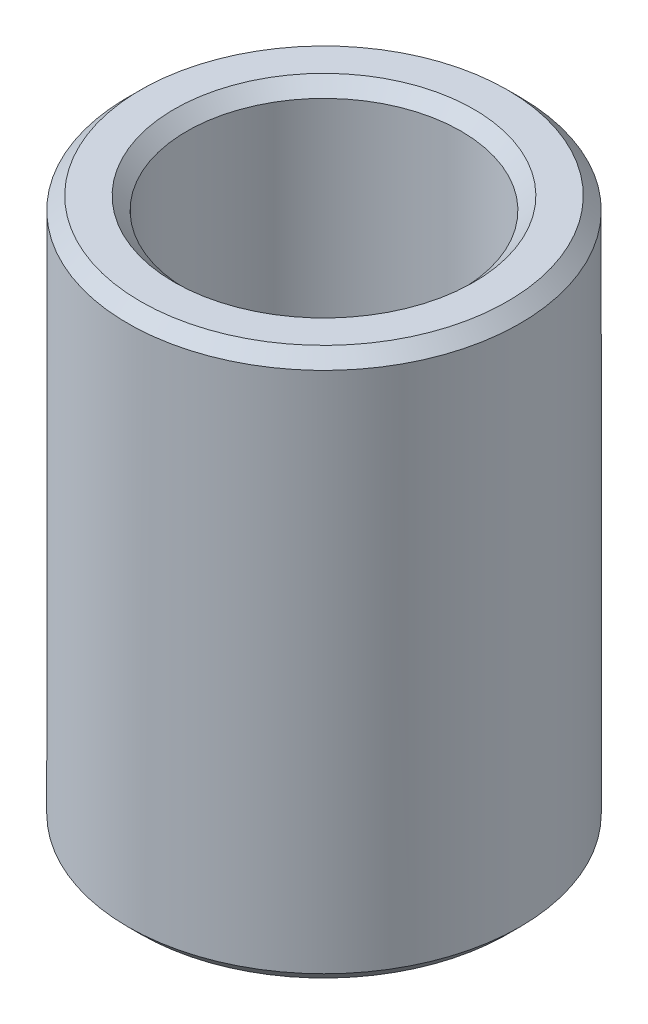
ISO-10303-21;
HEADER;
FILE_DESCRIPTION(('STEP AP214'),'2;1');
FILE_NAME('part.step','',(''),(''),'','','');
FILE_SCHEMA(('AUTOMOTIVE_DESIGN { 1 0 10303 214 1 1 1 1 }'));
ENDSEC;
DATA;
#1=APPLICATION_CONTEXT('core data for automotive mechanical design processes');
#2=APPLICATION_PROTOCOL_DEFINITION('international standard','automotive_design',2000,#1);
#3=PRODUCT_CONTEXT('',#1,'mechanical');
#4=PRODUCT('Part','Part','',(#3));
#5=PRODUCT_RELATED_PRODUCT_CATEGORY('part','',(#4));
#6=PRODUCT_DEFINITION_FORMATION('','',#4);
#7=PRODUCT_DEFINITION_CONTEXT('part definition',#1,'design');
#8=PRODUCT_DEFINITION('design','',#6,#7);
#9=PRODUCT_DEFINITION_SHAPE('','',#8);
#10=(LENGTH_UNIT() NAMED_UNIT(*) SI_UNIT(.MILLI.,.METRE.));
#11=(NAMED_UNIT(*) PLANE_ANGLE_UNIT() SI_UNIT($,.RADIAN.));
#12=(NAMED_UNIT(*) SI_UNIT($,.STERADIAN.) SOLID_ANGLE_UNIT());
#13=UNCERTAINTY_MEASURE_WITH_UNIT(LENGTH_MEASURE(1.E-05),#10,'distance_accuracy_value','');
#14=(GEOMETRIC_REPRESENTATION_CONTEXT(3) GLOBAL_UNCERTAINTY_ASSIGNED_CONTEXT((#13)) GLOBAL_UNIT_ASSIGNED_CONTEXT((#10,
#11,#12)) REPRESENTATION_CONTEXT('',''));
#15=CARTESIAN_POINT('',(0.,0.,0.));
#16=DIRECTION('',(0.,0.,1.));
#17=DIRECTION('',(1.,0.,0.));
#18=AXIS2_PLACEMENT_3D('',#15,#16,#17);
#19=CARTESIAN_POINT('',(0.,118.777284969492,0.));
#20=DIRECTION('',(0.,-1.,0.));
#21=DIRECTION('',(0.,0.,-1.));
#22=AXIS2_PLACEMENT_3D('',#19,#20,#21);
#23=CYLINDRICAL_SURFACE('',#22,42.5);
#24=CARTESIAN_POINT('',(0.,2.75292332349363,0.));
#25=DIRECTION('',(0.,1.,0.));
#26=DIRECTION('',(0.,0.,1.));
#27=AXIS2_PLACEMENT_3D('',#24,#25,#26);
#28=CIRCLE('',#27,42.5);
#29=CARTESIAN_POINT('',(0.,2.75292332349361,-42.5));
#30=VERTEX_POINT('',#29);
#31=EDGE_CURVE('E10',#30,#30,#28,.T.);
#32=CARTESIAN_POINT('',(0.,116.024361645999,0.));
#33=DIRECTION('',(0.,1.,0.));
#34=DIRECTION('',(0.,0.,1.));
#35=AXIS2_PLACEMENT_3D('',#32,#33,#34);
#36=CIRCLE('',#35,42.5);
#37=CARTESIAN_POINT('',(0.,116.024361645999,-42.5));
#38=VERTEX_POINT('',#37);
#39=EDGE_CURVE('E50',#38,#38,#36,.F.);
#40=CARTESIAN_POINT('',(0.,2.75292332349361,-42.5));
#41=CARTESIAN_POINT('',(0.,3.93283413935304,-42.5));
#42=CARTESIAN_POINT('',(0.,5.11274495521248,-42.5));
#43=CARTESIAN_POINT('',(0.,7.47256658693134,-42.5));
#44=CARTESIAN_POINT('',(0.,8.65247740279077,-42.5));
#45=CARTESIAN_POINT('',(0.,11.0122990345096,-42.5));
#46=CARTESIAN_POINT('',(0.,12.1922098503691,-42.5));
#47=CARTESIAN_POINT('',(0.,14.5520314820879,-42.5));
#48=CARTESIAN_POINT('',(0.,15.7319422979474,-42.5));
#49=CARTESIAN_POINT('',(0.,18.0917639296662,-42.5));
#50=CARTESIAN_POINT('',(0.,19.2716747455257,-42.5));
#51=CARTESIAN_POINT('',(0.,21.6314963772445,-42.5));
#52=CARTESIAN_POINT('',(0.,22.811407193104,-42.5));
#53=CARTESIAN_POINT('',(0.,25.1712288248228,-42.5));
#54=CARTESIAN_POINT('',(0.,26.3511396406822,-42.5));
#55=CARTESIAN_POINT('',(0.,28.7109612724011,-42.5));
#56=CARTESIAN_POINT('',(0.,29.8908720882605,-42.5));
#57=CARTESIAN_POINT('',(0.,32.2506937199794,-42.5));
#58=CARTESIAN_POINT('',(0.,33.4306045358388,-42.5));
#59=CARTESIAN_POINT('',(0.,35.7904261675577,-42.5));
#60=CARTESIAN_POINT('',(0.,36.9703369834171,-42.5));
#61=CARTESIAN_POINT('',(0.,39.330158615136,-42.5));
#62=CARTESIAN_POINT('',(0.,40.5100694309954,-42.5));
#63=CARTESIAN_POINT('',(0.,42.8698910627143,-42.5));
#64=CARTESIAN_POINT('',(0.,44.0498018785737,-42.5));
#65=CARTESIAN_POINT('',(0.,46.4096235102926,-42.5));
#66=CARTESIAN_POINT('',(0.,47.589534326152,-42.5));
#67=CARTESIAN_POINT('',(0.,49.9493559578709,-42.5));
#68=CARTESIAN_POINT('',(0.,51.1292667737303,-42.5));
#69=CARTESIAN_POINT('',(0.,53.4890884054492,-42.5));
#70=CARTESIAN_POINT('',(0.,54.6689992213086,-42.5));
#71=CARTESIAN_POINT('',(0.,57.0288208530275,-42.5));
#72=CARTESIAN_POINT('',(0.,58.2087316688869,-42.5));
#73=CARTESIAN_POINT('',(0.,60.5685533006057,-42.5));
#74=CARTESIAN_POINT('',(0.,61.7484641164652,-42.5));
#75=CARTESIAN_POINT('',(0.,64.108285748184,-42.5));
#76=CARTESIAN_POINT('',(0.,65.2881965640435,-42.5));
#77=CARTESIAN_POINT('',(0.,67.6480181957623,-42.5));
#78=CARTESIAN_POINT('',(0.,68.8279290116218,-42.5));
#79=CARTESIAN_POINT('',(0.,71.1877506433406,-42.5));
#80=CARTESIAN_POINT('',(0.,72.3676614592001,-42.5));
#81=CARTESIAN_POINT('',(0.,74.7274830909189,-42.5));
#82=CARTESIAN_POINT('',(0.,75.9073939067784,-42.5));
#83=CARTESIAN_POINT('',(0.,78.2672155384972,-42.5));
#84=CARTESIAN_POINT('',(0.,79.4471263543567,-42.5));
#85=CARTESIAN_POINT('',(0.,81.8069479860755,-42.5));
#86=CARTESIAN_POINT('',(0.,82.986858801935,-42.5));
#87=CARTESIAN_POINT('',(0.,85.3466804336538,-42.5));
#88=CARTESIAN_POINT('',(0.,86.5265912495133,-42.5));
#89=CARTESIAN_POINT('',(0.,88.8864128812321,-42.5));
#90=CARTESIAN_POINT('',(0.,90.0663236970915,-42.5));
#91=CARTESIAN_POINT('',(0.,92.4261453288104,-42.5));
#92=CARTESIAN_POINT('',(0.,93.6060561446698,-42.5));
#93=CARTESIAN_POINT('',(0.,95.9658777763887,-42.5));
#94=CARTESIAN_POINT('',(0.,97.1457885922481,-42.5));
#95=CARTESIAN_POINT('',(0.,99.505610223967,-42.5));
#96=CARTESIAN_POINT('',(0.,100.685521039826,-42.5));
#97=CARTESIAN_POINT('',(0.,103.045342671545,-42.5));
#98=CARTESIAN_POINT('',(0.,104.225253487405,-42.5));
#99=CARTESIAN_POINT('',(0.,106.585075119124,-42.5));
#100=CARTESIAN_POINT('',(0.,107.764985934983,-42.5));
#101=CARTESIAN_POINT('',(0.,110.124807566702,-42.5));
#102=CARTESIAN_POINT('',(0.,111.304718382561,-42.5));
#103=CARTESIAN_POINT('',(0.,113.66454001428,-42.5));
#104=CARTESIAN_POINT('',(0.,114.84445083014,-42.5));
#105=CARTESIAN_POINT('',(0.,116.024361645999,-42.5));
#106=B_SPLINE_CURVE_WITH_KNOTS('',3,(#40,#41,#42,#43,#44,#45,#46,#47,#48,#49,#50,#51,#52,#53,
#54,#55,#56,#57,#58,#59,#60,#61,#62,#63,#64,#65,#66,#67,#68,#69,#70,#71,#72,#73,#74,#75,#76,#77,
#78,#79,#80,#81,#82,#83,#84,#85,#86,#87,#88,#89,#90,#91,#92,#93,#94,#95,#96,#97,#98,#99,#100,
#101,#102,#103,#104,#105),.UNSPECIFIED.,.F.,.F.,(4,2,2,2,2,2,2,2,2,2,2,2,2,2,2,2,2,2,2,2,2,2,2,
2,2,2,2,2,2,2,2,2,4),(0.,3.5397324475783,7.0794648951566,10.6191973427349,14.1589297903132,
17.6986622378915,21.2383946854698,24.7781271330481,28.3178595806264,31.8575920282046,
35.397324475783,38.9370569233612,42.4767893709395,46.0165218185178,49.5562542660961,
53.0959867136744,56.6357191612527,60.175451608831,63.7151840564093,67.2549165039876,
70.7946489515659,74.3343813991442,77.8741138467225,81.4138462943008,84.9535787418791,
88.4933111894574,92.0330436370357,95.5727760846139,99.1125085321923,102.652240979771,
106.191973427349,109.731705874927,113.271438322505),.UNSPECIFIED.);
#107=EDGE_CURVE('BSEAM39',#30,#38,#106,.T.);
#108=ORIENTED_EDGE('',*,*,#31,.T.);
#109=ORIENTED_EDGE('',*,*,#39,.T.);
#110=ORIENTED_EDGE('',*,*,#107,.T.);
#111=ORIENTED_EDGE('',*,*,#107,.F.);
#112=EDGE_LOOP('',(#108,#110,#109,#111));
#113=FACE_BOUND('',#112,.T.);
#114=ADVANCED_FACE('F39',(#113),#23,.T.);
#115=CARTESIAN_POINT('',(0.,118.777284969492,0.));
#116=DIRECTION('',(0.,1.,0.));
#117=DIRECTION('',(0.,0.,1.));
#118=AXIS2_PLACEMENT_3D('',#115,#116,#117);
#119=PLANE('',#118);
#120=CARTESIAN_POINT('',(0.,118.777284969492,0.));
#121=DIRECTION('',(0.,1.,0.));
#122=DIRECTION('',(0.,0.,1.));
#123=AXIS2_PLACEMENT_3D('',#120,#121,#122);
#124=CIRCLE('',#123,32.4823454216008);
#125=CARTESIAN_POINT('',(0.,118.777284969492,32.4823454216008));
#126=VERTEX_POINT('',#125);
#127=EDGE_CURVE('E58',#126,#126,#124,.F.);
#128=ORIENTED_EDGE('',*,*,#127,.T.);
#129=EDGE_LOOP('',(#128));
#130=FACE_BOUND('',#129,.T.);
#131=CARTESIAN_POINT('',(0.,118.777284969492,0.));
#132=DIRECTION('',(0.,1.,0.));
#133=DIRECTION('',(0.,0.,1.));
#134=AXIS2_PLACEMENT_3D('',#131,#132,#133);
#135=CIRCLE('',#134,39.7470766765066);
#136=CARTESIAN_POINT('',(0.,118.777284969492,39.7470766765066));
#137=VERTEX_POINT('',#136);
#138=EDGE_CURVE('E61',#137,#137,#135,.T.);
#139=ORIENTED_EDGE('',*,*,#138,.T.);
#140=EDGE_LOOP('',(#139));
#141=FACE_BOUND('',#140,.T.);
#142=ADVANCED_FACE('F88',(#130,#141),#119,.T.);
#143=CARTESIAN_POINT('',(0.,0.,0.));
#144=DIRECTION('',(0.,1.,0.));
#145=DIRECTION('',(0.,0.,1.));
#146=AXIS2_PLACEMENT_3D('',#143,#144,#145);
#147=PLANE('',#146);
#148=CARTESIAN_POINT('',(0.,0.,0.));
#149=DIRECTION('',(0.,1.,0.));
#150=DIRECTION('',(0.,0.,1.));
#151=AXIS2_PLACEMENT_3D('',#148,#149,#150);
#152=CIRCLE('',#151,32.4823454216007);
#153=CARTESIAN_POINT('',(0.,0.,32.4823454216007));
#154=VERTEX_POINT('',#153);
#155=EDGE_CURVE('E51',#154,#154,#152,.T.);
#156=ORIENTED_EDGE('',*,*,#155,.T.);
#157=EDGE_LOOP('',(#156));
#158=FACE_BOUND('',#157,.T.);
#159=CARTESIAN_POINT('',(0.,0.,0.));
#160=DIRECTION('',(0.,1.,0.));
#161=DIRECTION('',(0.,0.,1.));
#162=AXIS2_PLACEMENT_3D('',#159,#160,#161);
#163=CIRCLE('',#162,39.7470766765064);
#164=CARTESIAN_POINT('',(0.,0.,39.7470766765064));
#165=VERTEX_POINT('',#164);
#166=EDGE_CURVE('E54',#165,#165,#163,.F.);
#167=ORIENTED_EDGE('',*,*,#166,.T.);
#168=EDGE_LOOP('',(#167));
#169=FACE_BOUND('',#168,.T.);
#170=ADVANCED_FACE('F83',(#158,#169),#147,.F.);
#171=CARTESIAN_POINT('',(0.,118.777284969492,0.));
#172=DIRECTION('',(0.,-1.,0.));
#173=DIRECTION('',(0.,0.,-1.));
#174=AXIS2_PLACEMENT_3D('',#171,#172,#173);
#175=CYLINDRICAL_SURFACE('',#174,29.7294220981071);
#176=CARTESIAN_POINT('',(0.,116.024361645999,0.));
#177=DIRECTION('',(0.,1.,0.));
#178=DIRECTION('',(0.,0.,1.));
#179=AXIS2_PLACEMENT_3D('',#176,#177,#178);
#180=CIRCLE('',#179,29.7294220981071);
#181=CARTESIAN_POINT('',(0.,116.024361645999,-29.7294220981071));
#182=VERTEX_POINT('',#181);
#183=EDGE_CURVE('E67',#182,#182,#180,.T.);
#184=CARTESIAN_POINT('',(0.,2.75292332349354,0.));
#185=DIRECTION('',(0.,1.,0.));
#186=DIRECTION('',(0.,0.,1.));
#187=AXIS2_PLACEMENT_3D('',#184,#185,#186);
#188=CIRCLE('',#187,29.7294220981071);
#189=CARTESIAN_POINT('',(0.,2.75292332349353,-29.7294220981071));
#190=VERTEX_POINT('',#189);
#191=EDGE_CURVE('E69',#190,#190,#188,.F.);
#192=CARTESIAN_POINT('',(0.,116.024361645999,-29.7294220981071));
#193=CARTESIAN_POINT('',(0.,114.844450830139,-29.7294220981071));
#194=CARTESIAN_POINT('',(0.,113.66454001428,-29.7294220981071));
#195=CARTESIAN_POINT('',(0.,111.304718382561,-29.7294220981071));
#196=CARTESIAN_POINT('',(0.,110.124807566702,-29.7294220981071));
#197=CARTESIAN_POINT('',(0.,107.764985934983,-29.7294220981071));
#198=CARTESIAN_POINT('',(0.,106.585075119123,-29.7294220981071));
#199=CARTESIAN_POINT('',(0.,104.225253487405,-29.7294220981071));
#200=CARTESIAN_POINT('',(0.,103.045342671545,-29.7294220981071));
#201=CARTESIAN_POINT('',(0.,100.685521039826,-29.7294220981071));
#202=CARTESIAN_POINT('',(0.,99.5056102239668,-29.7294220981071));
#203=CARTESIAN_POINT('',(0.,97.145788592248,-29.7294220981071));
#204=CARTESIAN_POINT('',(0.,95.9658777763885,-29.7294220981071));
#205=CARTESIAN_POINT('',(0.,93.6060561446697,-29.7294220981071));
#206=CARTESIAN_POINT('',(0.,92.4261453288102,-29.7294220981071));
#207=CARTESIAN_POINT('',(0.,90.0663236970914,-29.7294220981071));
#208=CARTESIAN_POINT('',(0.,88.8864128812319,-29.7294220981071));
#209=CARTESIAN_POINT('',(0.,86.5265912495131,-29.7294220981071));
#210=CARTESIAN_POINT('',(0.,85.3466804336536,-29.7294220981071));
#211=CARTESIAN_POINT('',(0.,82.9868588019348,-29.7294220981071));
#212=CARTESIAN_POINT('',(0.,81.8069479860754,-29.7294220981071));
#213=CARTESIAN_POINT('',(0.,79.4471263543565,-29.7294220981071));
#214=CARTESIAN_POINT('',(0.,78.2672155384971,-29.7294220981071));
#215=CARTESIAN_POINT('',(0.,75.9073939067782,-29.7294220981071));
#216=CARTESIAN_POINT('',(0.,74.7274830909188,-29.7294220981071));
#217=CARTESIAN_POINT('',(0.,72.3676614591999,-29.7294220981071));
#218=CARTESIAN_POINT('',(0.,71.1877506433405,-29.7294220981071));
#219=CARTESIAN_POINT('',(0.,68.8279290116216,-29.7294220981071));
#220=CARTESIAN_POINT('',(0.,67.6480181957622,-29.7294220981071));
#221=CARTESIAN_POINT('',(0.,65.2881965640433,-29.7294220981071));
#222=CARTESIAN_POINT('',(0.,64.1082857481839,-29.7294220981071));
#223=CARTESIAN_POINT('',(0.,61.748464116465,-29.7294220981071));
#224=CARTESIAN_POINT('',(0.,60.5685533006056,-29.7294220981071));
#225=CARTESIAN_POINT('',(0.,58.2087316688867,-29.7294220981071));
#226=CARTESIAN_POINT('',(0.,57.0288208530273,-29.7294220981071));
#227=CARTESIAN_POINT('',(0.,54.6689992213085,-29.7294220981071));
#228=CARTESIAN_POINT('',(0.,53.489088405449,-29.7294220981071));
#229=CARTESIAN_POINT('',(0.,51.1292667737302,-29.7294220981071));
#230=CARTESIAN_POINT('',(0.,49.9493559578708,-29.7294220981071));
#231=CARTESIAN_POINT('',(0.,47.5895343261519,-29.7294220981071));
#232=CARTESIAN_POINT('',(0.,46.4096235102924,-29.7294220981071));
#233=CARTESIAN_POINT('',(0.,44.0498018785736,-29.7294220981071));
#234=CARTESIAN_POINT('',(0.,42.8698910627142,-29.7294220981071));
#235=CARTESIAN_POINT('',(0.,40.5100694309953,-29.7294220981071));
#236=CARTESIAN_POINT('',(0.,39.3301586151359,-29.7294220981071));
#237=CARTESIAN_POINT('',(0.,36.970336983417,-29.7294220981071));
#238=CARTESIAN_POINT('',(0.,35.7904261675576,-29.7294220981071));
#239=CARTESIAN_POINT('',(0.,33.4306045358387,-29.7294220981071));
#240=CARTESIAN_POINT('',(0.,32.2506937199793,-29.7294220981071));
#241=CARTESIAN_POINT('',(0.,29.8908720882604,-29.7294220981071));
#242=CARTESIAN_POINT('',(0.,28.710961272401,-29.7294220981071));
#243=CARTESIAN_POINT('',(0.,26.3511396406821,-29.7294220981071));
#244=CARTESIAN_POINT('',(0.,25.1712288248227,-29.7294220981071));
#245=CARTESIAN_POINT('',(0.,22.8114071931038,-29.7294220981071));
#246=CARTESIAN_POINT('',(0.,21.6314963772444,-29.7294220981071));
#247=CARTESIAN_POINT('',(0.,19.2716747455256,-29.7294220981071));
#248=CARTESIAN_POINT('',(0.,18.0917639296661,-29.7294220981071));
#249=CARTESIAN_POINT('',(0.,15.7319422979473,-29.7294220981071));
#250=CARTESIAN_POINT('',(0.,14.5520314820878,-29.7294220981071));
#251=CARTESIAN_POINT('',(0.,12.192209850369,-29.7294220981071));
#252=CARTESIAN_POINT('',(0.,11.0122990345095,-29.7294220981071));
#253=CARTESIAN_POINT('',(0.,8.65247740279067,-29.7294220981071));
#254=CARTESIAN_POINT('',(0.,7.47256658693125,-29.7294220981071));
#255=CARTESIAN_POINT('',(0.,5.11274495521239,-29.7294220981071));
#256=CARTESIAN_POINT('',(0.,3.93283413935296,-29.7294220981071));
#257=CARTESIAN_POINT('',(0.,2.75292332349353,-29.7294220981071));
#258=B_SPLINE_CURVE_WITH_KNOTS('',3,(#192,#193,#194,#195,#196,#197,#198,#199,#200,#201,#202,
#203,#204,#205,#206,#207,#208,#209,#210,#211,#212,#213,#214,#215,#216,#217,#218,#219,#220,#221,
#222,#223,#224,#225,#226,#227,#228,#229,#230,#231,#232,#233,#234,#235,#236,#237,#238,#239,#240,
#241,#242,#243,#244,#245,#246,#247,#248,#249,#250,#251,#252,#253,#254,#255,#256,#257),
.UNSPECIFIED.,.F.,.F.,(4,2,2,2,2,2,2,2,2,2,2,2,2,2,2,2,2,2,2,2,2,2,2,2,2,2,2,2,2,2,2,2,4),(0.,
3.5397324475783,7.07946489515658,10.6191973427349,14.1589297903132,17.6986622378915,
21.2383946854698,24.778127133048,28.3178595806263,31.8575920282046,35.3973244757829,
38.9370569233612,42.4767893709395,46.0165218185178,49.5562542660961,53.0959867136744,
56.6357191612527,60.1754516088309,63.7151840564092,67.2549165039875,70.7946489515658,
74.3343813991441,77.8741138467224,81.4138462943007,84.953578741879,88.4933111894573,
92.0330436370356,95.5727760846138,99.1125085321922,102.65224097977,106.191973427349,
109.731705874927,113.271438322505),.UNSPECIFIED.);
#259=EDGE_CURVE('BSEAM71',#182,#190,#258,.T.);
#260=ORIENTED_EDGE('',*,*,#183,.T.);
#261=ORIENTED_EDGE('',*,*,#191,.T.);
#262=ORIENTED_EDGE('',*,*,#259,.T.);
#263=ORIENTED_EDGE('',*,*,#259,.F.);
#264=EDGE_LOOP('',(#260,#262,#261,#263));
#265=FACE_BOUND('',#264,.T.);
#266=ADVANCED_FACE('F71',(#265),#175,.F.);
#267=CARTESIAN_POINT('',(0.,116.024361645999,0.));
#268=DIRECTION('',(0.,1.,0.));
#269=DIRECTION('',(0.,0.,1.));
#270=AXIS2_PLACEMENT_3D('',#267,#268,#269);
#271=CONICAL_SURFACE('',#270,29.7294220981071,0.785398163397456);
#272=ORIENTED_EDGE('',*,*,#127,.F.);
#273=EDGE_LOOP('',(#272));
#274=FACE_BOUND('',#273,.T.);
#275=ORIENTED_EDGE('',*,*,#183,.F.);
#276=EDGE_LOOP('',(#275));
#277=FACE_BOUND('',#276,.T.);
#278=ADVANCED_FACE('F77',(#274,#277),#271,.F.);
#279=CARTESIAN_POINT('',(0.,0.,0.));
#280=DIRECTION('',(0.,-1.,0.));
#281=DIRECTION('',(0.,0.,-1.));
#282=AXIS2_PLACEMENT_3D('',#279,#280,#281);
#283=CONICAL_SURFACE('',#282,32.4823454216007,0.785398163397443);
#284=ORIENTED_EDGE('',*,*,#191,.F.);
#285=EDGE_LOOP('',(#284));
#286=FACE_BOUND('',#285,.T.);
#287=ORIENTED_EDGE('',*,*,#155,.F.);
#288=EDGE_LOOP('',(#287));
#289=FACE_BOUND('',#288,.T.);
#290=ADVANCED_FACE('F73',(#286,#289),#283,.F.);
#291=CARTESIAN_POINT('',(0.,2.75292332349363,0.));
#292=DIRECTION('',(0.,1.,0.));
#293=DIRECTION('',(0.,0.,1.));
#294=AXIS2_PLACEMENT_3D('',#291,#292,#293);
#295=CONICAL_SURFACE('',#294,42.5,0.785398163397452);
#296=ORIENTED_EDGE('',*,*,#166,.F.);
#297=EDGE_LOOP('',(#296));
#298=FACE_BOUND('',#297,.T.);
#299=ORIENTED_EDGE('',*,*,#31,.F.);
#300=EDGE_LOOP('',(#299));
#301=FACE_BOUND('',#300,.T.);
#302=ADVANCED_FACE('F76',(#298,#301),#295,.T.);
#303=CARTESIAN_POINT('',(0.,118.777284969492,0.));
#304=DIRECTION('',(0.,-1.,0.));
#305=DIRECTION('',(0.,0.,-1.));
#306=AXIS2_PLACEMENT_3D('',#303,#304,#305);
#307=CONICAL_SURFACE('',#306,39.7470766765066,0.785398163397445);
#308=ORIENTED_EDGE('',*,*,#39,.F.);
#309=EDGE_LOOP('',(#308));
#310=FACE_BOUND('',#309,.T.);
#311=ORIENTED_EDGE('',*,*,#138,.F.);
#312=EDGE_LOOP('',(#311));
#313=FACE_BOUND('',#312,.T.);
#314=ADVANCED_FACE('F45',(#310,#313),#307,.T.);
#315=CLOSED_SHELL('',(#114,#142,#170,#266,#278,#290,#302,#314));
#316=MANIFOLD_SOLID_BREP('B2',#315);
#317=ADVANCED_BREP_SHAPE_REPRESENTATION('',(#18,#316),#14);
#318=SHAPE_DEFINITION_REPRESENTATION(#9,#317);
ENDSEC;
END-ISO-10303-21;
